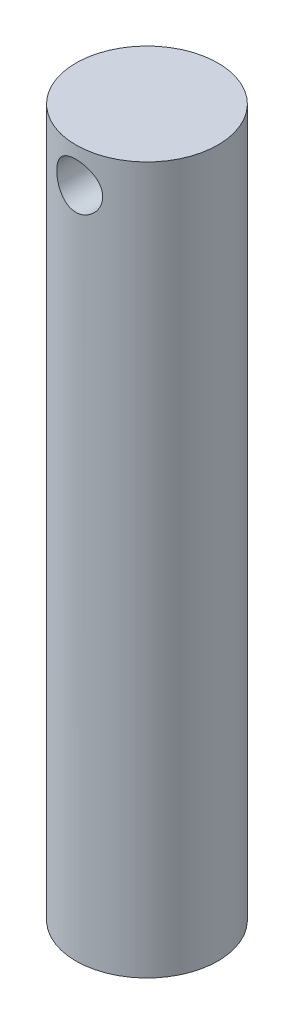
ISO-10303-21;
HEADER;
FILE_DESCRIPTION(('STEP AP214'),'2;1');
FILE_NAME('part.step','',(''),(''),'','','');
FILE_SCHEMA(('AUTOMOTIVE_DESIGN { 1 0 10303 214 1 1 1 1 }'));
ENDSEC;
DATA;
#1=APPLICATION_CONTEXT('core data for automotive mechanical design processes');
#2=APPLICATION_PROTOCOL_DEFINITION('international standard','automotive_design',2000,#1);
#3=PRODUCT_CONTEXT('',#1,'mechanical');
#4=PRODUCT('Part','Part','',(#3));
#5=PRODUCT_RELATED_PRODUCT_CATEGORY('part','',(#4));
#6=PRODUCT_DEFINITION_FORMATION('','',#4);
#7=PRODUCT_DEFINITION_CONTEXT('part definition',#1,'design');
#8=PRODUCT_DEFINITION('design','',#6,#7);
#9=PRODUCT_DEFINITION_SHAPE('','',#8);
#10=(LENGTH_UNIT() NAMED_UNIT(*) SI_UNIT(.MILLI.,.METRE.));
#11=(NAMED_UNIT(*) PLANE_ANGLE_UNIT() SI_UNIT($,.RADIAN.));
#12=(NAMED_UNIT(*) SI_UNIT($,.STERADIAN.) SOLID_ANGLE_UNIT());
#13=UNCERTAINTY_MEASURE_WITH_UNIT(LENGTH_MEASURE(1.E-05),#10,'distance_accuracy_value','');
#14=(GEOMETRIC_REPRESENTATION_CONTEXT(3) GLOBAL_UNCERTAINTY_ASSIGNED_CONTEXT((#13)) GLOBAL_UNIT_ASSIGNED_CONTEXT((#10,
#11,#12)) REPRESENTATION_CONTEXT('',''));
#15=CARTESIAN_POINT('',(0.,0.,0.));
#16=DIRECTION('',(0.,0.,1.));
#17=DIRECTION('',(1.,0.,0.));
#18=AXIS2_PLACEMENT_3D('',#15,#16,#17);
#19=CARTESIAN_POINT('',(0.,100.,0.));
#20=DIRECTION('',(0.,-1.,0.));
#21=DIRECTION('',(0.,0.,-1.));
#22=AXIS2_PLACEMENT_3D('',#19,#20,#21);
#23=CYLINDRICAL_SURFACE('',#22,10.05);
#24=CARTESIAN_POINT('',(0.,98.25,-10.05));
#25=CARTESIAN_POINT('',(-0.177626964132994,98.2499998229916,-10.0499997845731));
#26=CARTESIAN_POINT('',(-0.355257298720485,98.2353901617849,-10.0452469194969));
#27=CARTESIAN_POINT('',(-0.705303919370162,98.1775038734015,-10.0267537260201));
#28=CARTESIAN_POINT('',(-0.877719352462788,98.1342225828129,-10.0130119355844));
#29=CARTESIAN_POINT('',(-1.21223858598676,98.020619077554,-9.97803795678705));
#30=CARTESIAN_POINT('',(-1.37435852119963,97.9503404551648,-9.95681784811893));
#31=CARTESIAN_POINT('',(-1.68451184716288,97.7849286819837,-9.90906527053983));
#32=CARTESIAN_POINT('',(-1.83254271639945,97.6897910935622,-9.88253185333605));
#33=CARTESIAN_POINT('',(-2.11517548301474,97.4740783726044,-9.82598254670174));
#34=CARTESIAN_POINT('',(-2.24925049289571,97.3528339201376,-9.79588685021996));
#35=CARTESIAN_POINT('',(-2.49556165155084,97.089773165531,-9.7360551353515));
#36=CARTESIAN_POINT('',(-2.60779336108426,96.947952691902,-9.70631919122694));
#37=CARTESIAN_POINT('',(-2.81016620646384,96.6431107666812,-9.64970631842323));
#38=CARTESIAN_POINT('',(-2.89963541166109,96.4796233317584,-9.62292725705397));
#39=CARTESIAN_POINT('',(-3.04958719734344,96.1389164068621,-9.57646727442328));
#40=CARTESIAN_POINT('',(-3.11007803236127,95.9617008440959,-9.55678433221731));
#41=CARTESIAN_POINT('',(-3.19840290853164,95.604538021561,-9.52758280637221));
#42=CARTESIAN_POINT('',(-3.22721951542709,95.4248593960192,-9.51775927606348));
#43=CARTESIAN_POINT('',(-3.25444869302372,95.0629697207555,-9.50848515693909));
#44=CARTESIAN_POINT('',(-3.25287001269544,94.8807594148411,-9.50903158323752));
#45=CARTESIAN_POINT('',(-3.22011903005732,94.5272346597398,-9.52016745944607));
#46=CARTESIAN_POINT('',(-3.19021265569685,94.3557870859205,-9.53032727894704));
#47=CARTESIAN_POINT('',(-3.10371424443029,94.0204875130178,-9.55884463197767));
#48=CARTESIAN_POINT('',(-3.04711918753465,93.8566363758232,-9.57720309322191));
#49=CARTESIAN_POINT('',(-2.90798985715252,93.5382372208395,-9.62036645543659));
#50=CARTESIAN_POINT('',(-2.82506968670333,93.3838712441041,-9.64526624246983));
#51=CARTESIAN_POINT('',(-2.63591184331179,93.0908371738532,-9.69866512424216));
#52=CARTESIAN_POINT('',(-2.52966775869897,92.9521734127465,-9.72716520777498));
#53=CARTESIAN_POINT('',(-2.29073397671123,92.6873450887232,-9.78625987842274));
#54=CARTESIAN_POINT('',(-2.15700436131989,92.5621245767462,-9.81688870336431));
#55=CARTESIAN_POINT('',(-1.87006460745539,92.3356488974205,-9.87556455967564));
#56=CARTESIAN_POINT('',(-1.7168528157563,92.234395765994,-9.90361137159134));
#57=CARTESIAN_POINT('',(-1.3933844890511,92.0580280157092,-9.95429449303026));
#58=CARTESIAN_POINT('',(-1.22298901379211,91.9831528366815,-9.97688068408272));
#59=CARTESIAN_POINT('',(-0.871118225833777,91.8634160158595,-10.0137349871135));
#60=CARTESIAN_POINT('',(-0.689646547303581,91.8185445868103,-10.0280058113776));
#61=CARTESIAN_POINT('',(-0.328777038455603,91.7617302216742,-10.0461783569357));
#62=CARTESIAN_POINT('',(-0.149600173380903,91.7485105038734,-10.0504818959771));
#63=CARTESIAN_POINT('',(0.208438865115596,91.7517558083647,-10.0494319847672));
#64=CARTESIAN_POINT('',(0.387301083702304,91.7682161503876,-10.0440800570929));
#65=CARTESIAN_POINT('',(0.73461341554194,91.8293366482183,-10.0245852803557));
#66=CARTESIAN_POINT('',(0.903214230102458,91.8732247451479,-10.0106832707971));
#67=CARTESIAN_POINT('',(1.23060189404766,91.9870009307196,-9.97573283510058));
#68=CARTESIAN_POINT('',(1.38938750555442,92.0568922910822,-9.95468350971926));
#69=CARTESIAN_POINT('',(1.69713021125922,92.2226682288169,-9.90692329082229));
#70=CARTESIAN_POINT('',(1.84573502405538,92.3191681872387,-9.88008212364036));
#71=CARTESIAN_POINT('',(2.12506375689921,92.5346917980231,-9.82379457772532));
#72=CARTESIAN_POINT('',(2.2557824880515,92.6537219628102,-9.79434744704423));
#73=CARTESIAN_POINT('',(2.50141881560138,92.9169336817112,-9.73458148842499));
#74=CARTESIAN_POINT('',(2.61542562603993,93.061970915878,-9.70427899207083));
#75=CARTESIAN_POINT('',(2.81758013459185,93.3697734311455,-9.64752837591094));
#76=CARTESIAN_POINT('',(2.90572794666203,93.5325386341173,-9.62108023911986));
#77=CARTESIAN_POINT('',(3.05317937135018,93.8710361365204,-9.5753106561474));
#78=CARTESIAN_POINT('',(3.11256939364094,94.0467277395236,-9.55596790295287));
#79=CARTESIAN_POINT('',(3.20068058059627,94.4063802835222,-9.52682211127352));
#80=CARTESIAN_POINT('',(3.22941450239151,94.5903377515499,-9.51701510476456));
#81=CARTESIAN_POINT('',(3.25444019863056,94.9517237222386,-9.50848435543663));
#82=CARTESIAN_POINT('',(3.25223501025578,95.1290372390665,-9.50924710552684));
#83=CARTESIAN_POINT('',(3.2191099474494,95.4806302430641,-9.52051102323376));
#84=CARTESIAN_POINT('',(3.18819159649044,95.6549098907061,-9.53101167417362));
#85=CARTESIAN_POINT('',(3.09955448352023,95.9925904608986,-9.56019706275635));
#86=CARTESIAN_POINT('',(3.04229491577624,96.1561249971997,-9.57874127627958));
#87=CARTESIAN_POINT('',(2.90296733912834,96.4713941230088,-9.62187998267005));
#88=CARTESIAN_POINT('',(2.820894037325,96.6231261862973,-9.64647576616023));
#89=CARTESIAN_POINT('',(2.63029180799382,96.9173008464761,-9.70021869977333));
#90=CARTESIAN_POINT('',(2.52080671657571,97.0590970486037,-9.72951232119642));
#91=CARTESIAN_POINT('',(2.28013706865848,97.3227905330102,-9.78870836509797));
#92=CARTESIAN_POINT('',(2.14894654085446,97.4446823210706,-9.81861095311642));
#93=CARTESIAN_POINT('',(1.86293597938422,97.6694978509582,-9.87694241749253));
#94=CARTESIAN_POINT('',(1.70743736145422,97.7715847831758,-9.90528001060349));
#95=CARTESIAN_POINT('',(1.38057511759772,97.9480462316546,-9.95609403494617));
#96=CARTESIAN_POINT('',(1.20921664581636,98.022429711795,-9.97857236132625));
#97=CARTESIAN_POINT('',(0.866819744191755,98.137133182731,-10.0139312903026));
#98=CARTESIAN_POINT('',(0.696463509298191,98.1793294625737,-10.0273343225691));
#99=CARTESIAN_POINT('',(0.350738474745675,98.2357596258505,-10.0453677381873));
#100=CARTESIAN_POINT('',(0.175370880062972,98.2500001747602,-10.0500002126907));
#101=CARTESIAN_POINT('',(0.,98.25,-10.05));
#102=B_SPLINE_CURVE_WITH_KNOTS('',3,(#24,#25,#26,#27,#28,#29,#30,#31,#32,#33,#34,#35,#36,#37,
#38,#39,#40,#41,#42,#43,#44,#45,#46,#47,#48,#49,#50,#51,#52,#53,#54,#55,#56,#57,#58,#59,#60,#61,
#62,#63,#64,#65,#66,#67,#68,#69,#70,#71,#72,#73,#74,#75,#76,#77,#78,#79,#80,#81,#82,#83,#84,#85,
#86,#87,#88,#89,#90,#91,#92,#93,#94,#95,#96,#97,#98,#99,#100,#101),.UNSPECIFIED.,.T.,.F.,(4,2,2,
2,2,2,2,2,2,2,2,2,2,2,2,2,2,2,2,2,2,2,2,2,2,2,2,2,2,2,2,2,2,2,2,2,2,2,4),(0.,0.532235900221415,
1.06455838934414,1.59602493202381,2.12758641287599,2.67487471647411,3.22227413026769,
3.78433009627113,4.34622586444014,4.89015090432197,5.43391938332144,5.95447988826203,
6.47509931198434,7.00373315734355,7.5325125048561,8.08717484303597,8.64188428041339,
9.20150654248189,9.7609461660073,10.2974077836518,10.8337848136892,11.355704293725,
11.8776894636851,12.412938742653,12.9483429739729,13.5065640605045,14.0647826870006,
14.6213134400336,15.1776125097165,15.7069839251323,16.2363272545859,16.7567734146309,
17.2773306669844,17.8194806095349,18.3617799497766,18.9235236000427,19.4850853312529,
20.0106865056094,20.5361623458262),.UNSPECIFIED.);
#103=CARTESIAN_POINT('',(0.,98.25,-10.05));
#104=VERTEX_POINT('',#103);
#105=EDGE_CURVE('E10',#104,#104,#102,.T.);
#106=ORIENTED_EDGE('',*,*,#105,.T.);
#107=EDGE_LOOP('',(#106));
#108=FACE_BOUND('',#107,.T.);
#109=CARTESIAN_POINT('',(3.25,95.,9.509994742375));
#110=CARTESIAN_POINT('',(3.24999980569414,94.8226474146494,9.50999503508199));
#111=CARTESIAN_POINT('',(3.23543360848011,94.6452914675066,9.51501018973106));
#112=CARTESIAN_POINT('',(3.17773562613877,94.2958127046896,9.53443233119912));
#113=CARTESIAN_POINT('',(3.13459770441235,94.1236910215322,9.54884133560693));
#114=CARTESIAN_POINT('',(3.02141286513846,93.7897965937666,9.58525216270904));
#115=CARTESIAN_POINT('',(2.9514161818555,93.6280051833059,9.60723980322525));
#116=CARTESIAN_POINT('',(2.78667047098135,93.3184130556592,9.65631027353856));
#117=CARTESIAN_POINT('',(2.69191649694719,93.1706151423864,9.68339412124179));
#118=CARTESIAN_POINT('',(2.47661070092759,92.8877658341236,9.74072331084974));
#119=CARTESIAN_POINT('',(2.35530305738637,92.753304907592,9.7710440244714));
#120=CARTESIAN_POINT('',(2.0919485160912,92.5062358906017,9.83079143641105));
#121=CARTESIAN_POINT('',(1.949898509422,92.3936310818939,9.86021799991152));
#122=CARTESIAN_POINT('',(1.64480985132764,92.190827341436,9.91572910419368));
#123=CARTESIAN_POINT('',(1.48134374894992,92.1012419528542,9.94171461457925));
#124=CARTESIAN_POINT('',(1.14067950676041,91.9510699199495,9.98653152202684));
#125=CARTESIAN_POINT('',(0.963484850274068,91.8904759474941,10.0053647267218));
#126=CARTESIAN_POINT('',(0.606580290466169,91.8019941640945,10.0332213443857));
#127=CARTESIAN_POINT('',(0.427144914116161,91.7730959523661,10.0425471010008));
#128=CARTESIAN_POINT('',(0.065746048687928,91.7456187964391,10.0514086696753));
#129=CARTESIAN_POINT('',(-0.116216815430956,91.7470324859888,10.0509468602621));
#130=CARTESIAN_POINT('',(-0.470373294028504,91.7794865681775,10.0404929525446));
#131=CARTESIAN_POINT('',(-0.642679476324148,91.8094305536632,10.03085355505));
#132=CARTESIAN_POINT('',(-0.979674717691235,91.8962889576505,10.0035659991748));
#133=CARTESIAN_POINT('',(-1.1443632683188,91.9532051735885,9.98591730705598));
#134=CARTESIAN_POINT('',(-1.46390965842239,92.0930634409326,9.94413329813376));
#135=CARTESIAN_POINT('',(-1.61861572266744,92.176327476171,9.91991829158182));
#136=CARTESIAN_POINT('',(-1.91219221287219,92.3662559800916,9.86753721292513));
#137=CARTESIAN_POINT('',(-2.0510584083586,92.4729266780312,9.83937008975733));
#138=CARTESIAN_POINT('',(-2.31554360058982,92.712216462101,9.78058972707623));
#139=CARTESIAN_POINT('',(-2.44029887852763,92.8457785210247,9.7499234115263));
#140=CARTESIAN_POINT('',(-2.66590931859279,93.1322023531308,9.69066911694312));
#141=CARTESIAN_POINT('',(-2.76676123413104,93.2850667436668,9.66208142059604));
#142=CARTESIAN_POINT('',(-2.9428040236795,93.6083483798783,9.60994148391558));
#143=CARTESIAN_POINT('',(-3.01765220268255,93.7789641495927,9.58645791367288));
#144=CARTESIAN_POINT('',(-3.13727318234219,94.1313244999859,9.5479846825291));
#145=CARTESIAN_POINT('',(-3.18205770618912,94.3130647125355,9.53299171111338));
#146=CARTESIAN_POINT('',(-3.23856647282832,94.6741922605429,9.51393944133616));
#147=CARTESIAN_POINT('',(-3.25162191958985,94.8533481646208,9.50944022035047));
#148=CARTESIAN_POINT('',(-3.24805647370843,95.2113108457289,9.51065916903137));
#149=CARTESIAN_POINT('',(-3.2314405725103,95.390117676416,9.51637562017273));
#150=CARTESIAN_POINT('',(-3.17019721519305,95.7364098960469,9.53694527103496));
#151=CARTESIAN_POINT('',(-3.1264735026359,95.9040744937906,9.55150339206147));
#152=CARTESIAN_POINT('',(-3.01332874986447,96.2296612688295,9.5877972307286));
#153=CARTESIAN_POINT('',(-2.9439033268959,96.3875817791642,9.60953417246102));
#154=CARTESIAN_POINT('',(-2.77893236031484,96.6944920240326,9.65855230650666));
#155=CARTESIAN_POINT('',(-2.6826597166392,96.8430666779067,9.68598141724232));
#156=CARTESIAN_POINT('',(-2.46756307726761,97.1224352048414,9.74299707269916));
#157=CARTESIAN_POINT('',(-2.34873281366986,97.2532241185458,9.77258421564476));
#158=CARTESIAN_POINT('',(-2.08556008048428,97.4993654850169,9.83218761272364));
#159=CARTESIAN_POINT('',(-1.9403124395426,97.613762566693,9.86216360048574));
#160=CARTESIAN_POINT('',(-1.63195012093622,97.816609446335,9.91785005483854));
#161=CARTESIAN_POINT('',(-1.4688361776181,97.9050603102017,9.94356069663573));
#162=CARTESIAN_POINT('',(-1.13028636870153,98.0526711262223,9.98768522269631));
#163=CARTESIAN_POINT('',(-0.954945718778015,98.1120336412628,10.00614938451));
#164=CARTESIAN_POINT('',(-0.596060926030486,98.2002067221681,10.033919937448));
#165=CARTESIAN_POINT('',(-0.412519573666049,98.2290275991843,10.0432294192041));
#166=CARTESIAN_POINT('',(-0.0512083852183754,98.2544146138159,10.0514221489684));
#167=CARTESIAN_POINT('',(0.1264558184582,98.2523562194237,10.050750025627));
#168=CARTESIAN_POINT('',(0.478790430102893,98.2194037405362,10.0401353948804));
#169=CARTESIAN_POINT('',(0.653461056362011,98.1885117677681,10.0301935663742));
#170=CARTESIAN_POINT('',(0.992395350083574,98.0996646417197,10.0023090639272));
#171=CARTESIAN_POINT('',(1.15677158504729,98.0421000622267,9.98448202076337));
#172=CARTESIAN_POINT('',(1.47360440032954,97.9018987753185,9.94266333901966));
#173=CARTESIAN_POINT('',(1.62605886682788,97.8192576342584,9.9186706104348));
#174=CARTESIAN_POINT('',(1.92062086432997,97.627860922421,9.86594693537958));
#175=CARTESIAN_POINT('',(2.06216825751103,97.5182817774207,9.83707792002803));
#176=CARTESIAN_POINT('',(2.3253188055922,97.2775452920522,9.77822114200553));
#177=CARTESIAN_POINT('',(2.44691576549454,97.14638127439,9.7482330353697));
#178=CARTESIAN_POINT('',(2.67117288166223,96.8605139867793,9.68923561201554));
#179=CARTESIAN_POINT('',(2.77298815972452,96.7051304681509,9.66030102742214));
#180=CARTESIAN_POINT('',(2.94896836858405,96.3785707990138,9.60804642378159));
#181=CARTESIAN_POINT('',(3.02314249082615,96.2073999218981,9.58472453927255));
#182=CARTESIAN_POINT('',(3.13748851221476,95.8654653847864,9.54788216761));
#183=CARTESIAN_POINT('',(3.17954910179661,95.6953912431422,9.53382536710284));
#184=CARTESIAN_POINT('',(3.23580084356397,95.3502114966844,9.51488285853423));
#185=CARTESIAN_POINT('',(3.25000019184605,95.175107386949,9.50999445337353));
#186=CARTESIAN_POINT('',(3.25,95.,9.509994742375));
#187=B_SPLINE_CURVE_WITH_KNOTS('',3,(#109,#110,#111,#112,#113,#114,#115,#116,#117,#118,#119,
#120,#121,#122,#123,#124,#125,#126,#127,#128,#129,#130,#131,#132,#133,#134,#135,#136,#137,#138,
#139,#140,#141,#142,#143,#144,#145,#146,#147,#148,#149,#150,#151,#152,#153,#154,#155,#156,#157,
#158,#159,#160,#161,#162,#163,#164,#165,#166,#167,#168,#169,#170,#171,#172,#173,#174,#175,#176,
#177,#178,#179,#180,#181,#182,#183,#184,#185,#186),.UNSPECIFIED.,.T.,.F.,(4,2,2,2,2,2,2,2,2,2,2,
2,2,2,2,2,2,2,2,2,2,2,2,2,2,2,2,2,2,2,2,2,2,2,2,2,2,2,4),(0.,0.531410091403595,1.0629343554266,
1.59346931097095,2.12411034719862,2.672471446403,3.22091481981048,3.78273626770636,
4.34441562940653,4.88761660861634,5.43068558324482,5.95369235385843,6.47673398268107,
7.0064317688814,7.53627069585258,8.0896714924933,8.64314740980917,9.20366293058929,
9.76395975364088,10.3003091878815,10.8365684035578,11.35584517454,11.8752105354078,
12.4102984280629,12.9455352194321,13.504776612058,14.0639950271811,14.6192618153122,
15.1743410802437,15.7047715754262,16.2351632257379,16.7580224116625,17.2809740952782,
17.8225076249231,18.3642089943105,18.9255203514589,19.4866448902289,20.0114820029693,
20.5361646982911),.UNSPECIFIED.);
#188=CARTESIAN_POINT('',(3.25,95.,9.509994742375));
#189=VERTEX_POINT('',#188);
#190=EDGE_CURVE('E42',#189,#189,#187,.T.);
#191=ORIENTED_EDGE('',*,*,#190,.T.);
#192=EDGE_LOOP('',(#191));
#193=FACE_BOUND('',#192,.T.);
#194=CARTESIAN_POINT('',(0.,100.,0.));
#195=DIRECTION('',(0.,1.,0.));
#196=DIRECTION('',(0.,0.,1.));
#197=AXIS2_PLACEMENT_3D('',#194,#195,#196);
#198=CIRCLE('',#197,10.05);
#199=CARTESIAN_POINT('',(0.,100.,10.05));
#200=VERTEX_POINT('',#199);
#201=EDGE_CURVE('E46',#200,#200,#198,.T.);
#202=ORIENTED_EDGE('',*,*,#201,.F.);
#203=EDGE_LOOP('',(#202));
#204=FACE_BOUND('',#203,.T.);
#205=CARTESIAN_POINT('',(0.,0.,0.));
#206=DIRECTION('',(0.,1.,0.));
#207=DIRECTION('',(0.,0.,1.));
#208=AXIS2_PLACEMENT_3D('',#205,#206,#207);
#209=CIRCLE('',#208,10.05);
#210=CARTESIAN_POINT('',(0.,0.,10.05));
#211=VERTEX_POINT('',#210);
#212=EDGE_CURVE('E50',#211,#211,#209,.T.);
#213=ORIENTED_EDGE('',*,*,#212,.T.);
#214=EDGE_LOOP('',(#213));
#215=FACE_BOUND('',#214,.T.);
#216=ADVANCED_FACE('F31',(#108,#193,#204,#215),#23,.T.);
#217=CARTESIAN_POINT('',(0.,100.,0.));
#218=DIRECTION('',(0.,1.,0.));
#219=DIRECTION('',(0.,0.,1.));
#220=AXIS2_PLACEMENT_3D('',#217,#218,#219);
#221=PLANE('',#220);
#222=ORIENTED_EDGE('',*,*,#201,.T.);
#223=EDGE_LOOP('',(#222));
#224=FACE_BOUND('',#223,.T.);
#225=ADVANCED_FACE('F62',(#224),#221,.T.);
#226=CARTESIAN_POINT('',(0.,0.,0.));
#227=DIRECTION('',(0.,1.,0.));
#228=DIRECTION('',(0.,0.,1.));
#229=AXIS2_PLACEMENT_3D('',#226,#227,#228);
#230=PLANE('',#229);
#231=ORIENTED_EDGE('',*,*,#212,.F.);
#232=EDGE_LOOP('',(#231));
#233=FACE_BOUND('',#232,.T.);
#234=ADVANCED_FACE('F60',(#233),#230,.F.);
#235=CARTESIAN_POINT('',(0.,95.,-10.05));
#236=DIRECTION('',(0.,0.,1.));
#237=DIRECTION('',(1.,0.,0.));
#238=AXIS2_PLACEMENT_3D('',#235,#236,#237);
#239=CYLINDRICAL_SURFACE('',#238,3.25);
#240=ORIENTED_EDGE('',*,*,#190,.F.);
#241=EDGE_LOOP('',(#240));
#242=FACE_BOUND('',#241,.T.);
#243=ORIENTED_EDGE('',*,*,#105,.F.);
#244=EDGE_LOOP('',(#243));
#245=FACE_BOUND('',#244,.T.);
#246=ADVANCED_FACE('F56',(#242,#245),#239,.F.);
#247=CLOSED_SHELL('',(#216,#225,#234,#246));
#248=MANIFOLD_SOLID_BREP('B2',#247);
#249=ADVANCED_BREP_SHAPE_REPRESENTATION('',(#18,#248),#14);
#250=SHAPE_DEFINITION_REPRESENTATION(#9,#249);
ENDSEC;
END-ISO-10303-21;
